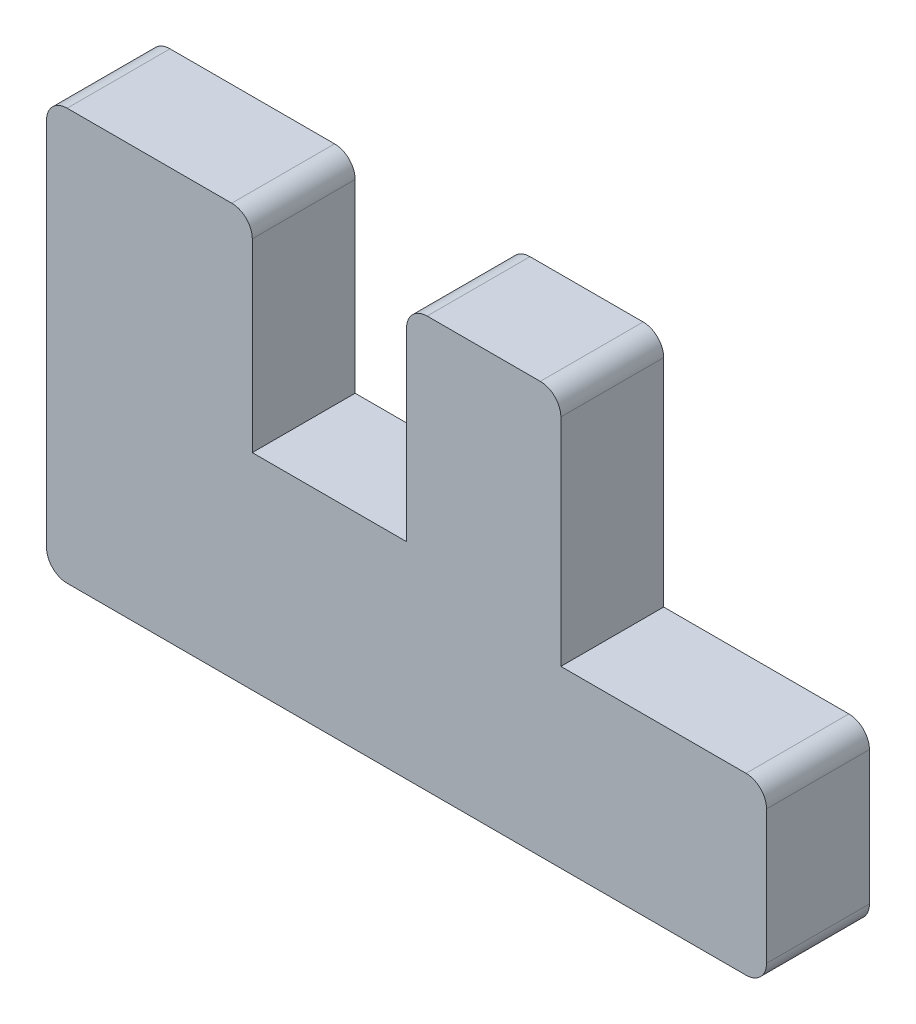
ISO-10303-21;
HEADER;
FILE_DESCRIPTION(('STEP AP214'),'2;1');
FILE_NAME('part.step','',(''),(''),'','','');
FILE_SCHEMA(('AUTOMOTIVE_DESIGN { 1 0 10303 214 1 1 1 1 }'));
ENDSEC;
DATA;
#1=APPLICATION_CONTEXT('core data for automotive mechanical design processes');
#2=APPLICATION_PROTOCOL_DEFINITION('international standard','automotive_design',2000,#1);
#3=PRODUCT_CONTEXT('',#1,'mechanical');
#4=PRODUCT('Part','Part','',(#3));
#5=PRODUCT_RELATED_PRODUCT_CATEGORY('part','',(#4));
#6=PRODUCT_DEFINITION_FORMATION('','',#4);
#7=PRODUCT_DEFINITION_CONTEXT('part definition',#1,'design');
#8=PRODUCT_DEFINITION('design','',#6,#7);
#9=PRODUCT_DEFINITION_SHAPE('','',#8);
#10=(LENGTH_UNIT() NAMED_UNIT(*) SI_UNIT(.MILLI.,.METRE.));
#11=(NAMED_UNIT(*) PLANE_ANGLE_UNIT() SI_UNIT($,.RADIAN.));
#12=(NAMED_UNIT(*) SI_UNIT($,.STERADIAN.) SOLID_ANGLE_UNIT());
#13=UNCERTAINTY_MEASURE_WITH_UNIT(LENGTH_MEASURE(1.E-05),#10,'distance_accuracy_value','');
#14=(GEOMETRIC_REPRESENTATION_CONTEXT(3) GLOBAL_UNCERTAINTY_ASSIGNED_CONTEXT((#13)) GLOBAL_UNIT_ASSIGNED_CONTEXT((#10,
#11,#12)) REPRESENTATION_CONTEXT('',''));
#15=CARTESIAN_POINT('',(0.,0.,0.));
#16=DIRECTION('',(0.,0.,1.));
#17=DIRECTION('',(1.,0.,0.));
#18=AXIS2_PLACEMENT_3D('',#15,#16,#17);
#19=CARTESIAN_POINT('',(0.,0.,12.7));
#20=DIRECTION('',(0.,1.,0.));
#21=DIRECTION('',(0.,0.,1.));
#22=AXIS2_PLACEMENT_3D('',#19,#20,#21);
#23=PLANE('',#22);
#24=DIRECTION('',(1.,0.,0.));
#25=VECTOR('',#24,1.);
#26=CARTESIAN_POINT('',(0.,0.,0.));
#27=LINE('',#26,#25);
#28=CARTESIAN_POINT('',(2.54,0.,0.));
#29=VERTEX_POINT('',#28);
#30=CARTESIAN_POINT('',(86.36,0.,0.));
#31=VERTEX_POINT('',#30);
#32=EDGE_CURVE('E219',#29,#31,#27,.T.);
#33=ORIENTED_EDGE('',*,*,#32,.T.);
#34=DIRECTION('',(0.,0.,-1.));
#35=VECTOR('',#34,1.);
#36=CARTESIAN_POINT('',(86.36,0.,12.7));
#37=LINE('',#36,#35);
#38=CARTESIAN_POINT('',(86.36,0.,12.7));
#39=VERTEX_POINT('',#38);
#40=EDGE_CURVE('E291',#31,#39,#37,.F.);
#41=ORIENTED_EDGE('',*,*,#40,.T.);
#42=DIRECTION('',(1.,0.,0.));
#43=VECTOR('',#42,1.);
#44=CARTESIAN_POINT('',(0.,0.,12.7));
#45=LINE('',#44,#43);
#46=CARTESIAN_POINT('',(2.54,0.,12.7));
#47=VERTEX_POINT('',#46);
#48=EDGE_CURVE('E253',#47,#39,#45,.T.);
#49=ORIENTED_EDGE('',*,*,#48,.F.);
#50=DIRECTION('',(0.,0.,-1.));
#51=VECTOR('',#50,1.);
#52=CARTESIAN_POINT('',(2.54,0.,12.7));
#53=LINE('',#52,#51);
#54=EDGE_CURVE('E287',#47,#29,#53,.T.);
#55=ORIENTED_EDGE('',*,*,#54,.T.);
#56=EDGE_LOOP('',(#33,#41,#49,#55));
#57=FACE_BOUND('',#56,.T.);
#58=ADVANCED_FACE('F43',(#57),#23,.F.);
#59=CARTESIAN_POINT('',(88.9,0.,12.7));
#60=DIRECTION('',(-1.,0.,0.));
#61=DIRECTION('',(0.,0.,1.));
#62=AXIS2_PLACEMENT_3D('',#59,#60,#61);
#63=PLANE('',#62);
#64=DIRECTION('',(0.,1.,0.));
#65=VECTOR('',#64,1.);
#66=CARTESIAN_POINT('',(88.9,0.,12.7));
#67=LINE('',#66,#65);
#68=CARTESIAN_POINT('',(88.9,2.54,12.7));
#69=VERTEX_POINT('',#68);
#70=CARTESIAN_POINT('',(88.9,19.05,12.7));
#71=VERTEX_POINT('',#70);
#72=EDGE_CURVE('E178',#69,#71,#67,.T.);
#73=ORIENTED_EDGE('',*,*,#72,.F.);
#74=DIRECTION('',(0.,0.,-1.));
#75=VECTOR('',#74,1.);
#76=CARTESIAN_POINT('',(88.9,2.54,12.7));
#77=LINE('',#76,#75);
#78=CARTESIAN_POINT('',(88.9,2.54,0.));
#79=VERTEX_POINT('',#78);
#80=EDGE_CURVE('E262',#69,#79,#77,.T.);
#81=ORIENTED_EDGE('',*,*,#80,.T.);
#82=DIRECTION('',(0.,1.,0.));
#83=VECTOR('',#82,1.);
#84=CARTESIAN_POINT('',(88.9,0.,0.));
#85=LINE('',#84,#83);
#86=CARTESIAN_POINT('',(88.9,19.05,0.));
#87=VERTEX_POINT('',#86);
#88=EDGE_CURVE('E223',#79,#87,#85,.T.);
#89=ORIENTED_EDGE('',*,*,#88,.T.);
#90=DIRECTION('',(0.,0.,-1.));
#91=VECTOR('',#90,1.);
#92=CARTESIAN_POINT('',(88.9,19.05,12.7));
#93=LINE('',#92,#91);
#94=EDGE_CURVE('E189',#87,#71,#93,.F.);
#95=ORIENTED_EDGE('',*,*,#94,.T.);
#96=EDGE_LOOP('',(#73,#81,#89,#95));
#97=FACE_BOUND('',#96,.T.);
#98=ADVANCED_FACE('F373',(#97),#63,.F.);
#99=CARTESIAN_POINT('',(88.9,21.59,12.7));
#100=DIRECTION('',(0.,-1.,0.));
#101=DIRECTION('',(0.,0.,-1.));
#102=AXIS2_PLACEMENT_3D('',#99,#100,#101);
#103=PLANE('',#102);
#104=DIRECTION('',(-1.,0.,0.));
#105=VECTOR('',#104,1.);
#106=CARTESIAN_POINT('',(88.9,21.59,12.7));
#107=LINE('',#106,#105);
#108=CARTESIAN_POINT('',(86.36,21.59,12.7));
#109=VERTEX_POINT('',#108);
#110=CARTESIAN_POINT('',(63.5,21.59,12.7));
#111=VERTEX_POINT('',#110);
#112=EDGE_CURVE('E164',#109,#111,#107,.T.);
#113=ORIENTED_EDGE('',*,*,#112,.F.);
#114=DIRECTION('',(0.,0.,-1.));
#115=VECTOR('',#114,1.);
#116=CARTESIAN_POINT('',(86.36,21.59,12.7));
#117=LINE('',#116,#115);
#118=CARTESIAN_POINT('',(86.36,21.59,0.));
#119=VERTEX_POINT('',#118);
#120=EDGE_CURVE('E313',#109,#119,#117,.T.);
#121=ORIENTED_EDGE('',*,*,#120,.T.);
#122=DIRECTION('',(-1.,0.,0.));
#123=VECTOR('',#122,1.);
#124=CARTESIAN_POINT('',(88.9,21.59,0.));
#125=LINE('',#124,#123);
#126=CARTESIAN_POINT('',(63.5,21.59,0.));
#127=VERTEX_POINT('',#126);
#128=EDGE_CURVE('E184',#119,#127,#125,.T.);
#129=ORIENTED_EDGE('',*,*,#128,.T.);
#130=DIRECTION('',(0.,0.,-1.));
#131=VECTOR('',#130,1.);
#132=CARTESIAN_POINT('',(63.5,21.59,12.7));
#133=LINE('',#132,#131);
#134=EDGE_CURVE('E181',#111,#127,#133,.T.);
#135=ORIENTED_EDGE('',*,*,#134,.F.);
#136=EDGE_LOOP('',(#113,#121,#129,#135));
#137=FACE_BOUND('',#136,.T.);
#138=ADVANCED_FACE('F182',(#137),#103,.F.);
#139=CARTESIAN_POINT('',(63.5,50.8,12.7));
#140=DIRECTION('',(-1.,0.,0.));
#141=DIRECTION('',(0.,0.,1.));
#142=AXIS2_PLACEMENT_3D('',#139,#140,#141);
#143=PLANE('',#142);
#144=DIRECTION('',(0.,1.,0.));
#145=VECTOR('',#144,1.);
#146=CARTESIAN_POINT('',(63.5,50.8,0.));
#147=LINE('',#146,#145);
#148=CARTESIAN_POINT('',(63.5,48.26,0.));
#149=VERTEX_POINT('',#148);
#150=EDGE_CURVE('E229',#127,#149,#147,.T.);
#151=ORIENTED_EDGE('',*,*,#150,.T.);
#152=DIRECTION('',(0.,0.,-1.));
#153=VECTOR('',#152,1.);
#154=CARTESIAN_POINT('',(63.5,48.26,12.7));
#155=LINE('',#154,#153);
#156=CARTESIAN_POINT('',(63.5,48.26,12.7));
#157=VERTEX_POINT('',#156);
#158=EDGE_CURVE('E52',#149,#157,#155,.F.);
#159=ORIENTED_EDGE('',*,*,#158,.T.);
#160=DIRECTION('',(0.,1.,0.));
#161=VECTOR('',#160,1.);
#162=CARTESIAN_POINT('',(63.5,50.8,12.7));
#163=LINE('',#162,#161);
#164=EDGE_CURVE('E169',#111,#157,#163,.T.);
#165=ORIENTED_EDGE('',*,*,#164,.F.);
#166=ORIENTED_EDGE('',*,*,#134,.T.);
#167=EDGE_LOOP('',(#151,#159,#165,#166));
#168=FACE_BOUND('',#167,.T.);
#169=ADVANCED_FACE('F192',(#168),#143,.F.);
#170=CARTESIAN_POINT('',(44.45,50.8,12.7));
#171=DIRECTION('',(0.,-1.,0.));
#172=DIRECTION('',(0.,0.,-1.));
#173=AXIS2_PLACEMENT_3D('',#170,#171,#172);
#174=PLANE('',#173);
#175=DIRECTION('',(-1.,0.,0.));
#176=VECTOR('',#175,1.);
#177=CARTESIAN_POINT('',(44.45,50.8,12.7));
#178=LINE('',#177,#176);
#179=CARTESIAN_POINT('',(60.96,50.8,12.7));
#180=VERTEX_POINT('',#179);
#181=CARTESIAN_POINT('',(46.99,50.8,12.7));
#182=VERTEX_POINT('',#181);
#183=EDGE_CURVE('E195',#180,#182,#178,.T.);
#184=ORIENTED_EDGE('',*,*,#183,.F.);
#185=DIRECTION('',(0.,0.,-1.));
#186=VECTOR('',#185,1.);
#187=CARTESIAN_POINT('',(60.96,50.8,12.7));
#188=LINE('',#187,#186);
#189=CARTESIAN_POINT('',(60.96,50.8,0.));
#190=VERTEX_POINT('',#189);
#191=EDGE_CURVE('E335',#180,#190,#188,.T.);
#192=ORIENTED_EDGE('',*,*,#191,.T.);
#193=DIRECTION('',(-1.,0.,0.));
#194=VECTOR('',#193,1.);
#195=CARTESIAN_POINT('',(44.45,50.8,0.));
#196=LINE('',#195,#194);
#197=CARTESIAN_POINT('',(46.99,50.8,0.));
#198=VERTEX_POINT('',#197);
#199=EDGE_CURVE('E232',#190,#198,#196,.T.);
#200=ORIENTED_EDGE('',*,*,#199,.T.);
#201=DIRECTION('',(0.,0.,-1.));
#202=VECTOR('',#201,1.);
#203=CARTESIAN_POINT('',(46.99,50.8,12.7));
#204=LINE('',#203,#202);
#205=EDGE_CURVE('E332',#198,#182,#204,.F.);
#206=ORIENTED_EDGE('',*,*,#205,.T.);
#207=EDGE_LOOP('',(#184,#192,#200,#206));
#208=FACE_BOUND('',#207,.T.);
#209=ADVANCED_FACE('F343',(#208),#174,.F.);
#210=CARTESIAN_POINT('',(44.45,25.4,12.7));
#211=DIRECTION('',(1.,0.,0.));
#212=DIRECTION('',(0.,0.,-1.));
#213=AXIS2_PLACEMENT_3D('',#210,#211,#212);
#214=PLANE('',#213);
#215=DIRECTION('',(0.,-1.,0.));
#216=VECTOR('',#215,1.);
#217=CARTESIAN_POINT('',(44.45,25.4,12.7));
#218=LINE('',#217,#216);
#219=CARTESIAN_POINT('',(44.45,48.26,12.7));
#220=VERTEX_POINT('',#219);
#221=CARTESIAN_POINT('',(44.45,25.4,12.7));
#222=VERTEX_POINT('',#221);
#223=EDGE_CURVE('E199',#220,#222,#218,.T.);
#224=ORIENTED_EDGE('',*,*,#223,.F.);
#225=DIRECTION('',(0.,0.,-1.));
#226=VECTOR('',#225,1.);
#227=CARTESIAN_POINT('',(44.45,48.26,12.7));
#228=LINE('',#227,#226);
#229=CARTESIAN_POINT('',(44.45,48.26,0.));
#230=VERTEX_POINT('',#229);
#231=EDGE_CURVE('E11',#220,#230,#228,.T.);
#232=ORIENTED_EDGE('',*,*,#231,.T.);
#233=DIRECTION('',(0.,-1.,0.));
#234=VECTOR('',#233,1.);
#235=CARTESIAN_POINT('',(44.45,25.4,0.));
#236=LINE('',#235,#234);
#237=CARTESIAN_POINT('',(44.45,25.4,0.));
#238=VERTEX_POINT('',#237);
#239=EDGE_CURVE('E236',#230,#238,#236,.T.);
#240=ORIENTED_EDGE('',*,*,#239,.T.);
#241=DIRECTION('',(0.,0.,-1.));
#242=VECTOR('',#241,1.);
#243=CARTESIAN_POINT('',(44.45,25.4,12.7));
#244=LINE('',#243,#242);
#245=EDGE_CURVE('E190',#222,#238,#244,.T.);
#246=ORIENTED_EDGE('',*,*,#245,.F.);
#247=EDGE_LOOP('',(#224,#232,#240,#246));
#248=FACE_BOUND('',#247,.T.);
#249=ADVANCED_FACE('F357',(#248),#214,.F.);
#250=CARTESIAN_POINT('',(25.4,25.4,12.7));
#251=DIRECTION('',(0.,-1.,0.));
#252=DIRECTION('',(1.,0.,0.));
#253=AXIS2_PLACEMENT_3D('',#250,#251,#252);
#254=PLANE('',#253);
#255=DIRECTION('',(-1.,0.,0.));
#256=VECTOR('',#255,1.);
#257=CARTESIAN_POINT('',(25.4,25.4,0.));
#258=LINE('',#257,#256);
#259=CARTESIAN_POINT('',(25.4,25.4,0.));
#260=VERTEX_POINT('',#259);
#261=EDGE_CURVE('E239',#238,#260,#258,.T.);
#262=ORIENTED_EDGE('',*,*,#261,.T.);
#263=DIRECTION('',(0.,0.,-1.));
#264=VECTOR('',#263,1.);
#265=CARTESIAN_POINT('',(25.4,25.4,12.7));
#266=LINE('',#265,#264);
#267=CARTESIAN_POINT('',(25.4,25.4,12.7));
#268=VERTEX_POINT('',#267);
#269=EDGE_CURVE('E218',#268,#260,#266,.T.);
#270=ORIENTED_EDGE('',*,*,#269,.F.);
#271=DIRECTION('',(-1.,0.,0.));
#272=VECTOR('',#271,1.);
#273=CARTESIAN_POINT('',(25.4,25.4,12.7));
#274=LINE('',#273,#272);
#275=EDGE_CURVE('E205',#222,#268,#274,.T.);
#276=ORIENTED_EDGE('',*,*,#275,.F.);
#277=ORIENTED_EDGE('',*,*,#245,.T.);
#278=EDGE_LOOP('',(#262,#270,#276,#277));
#279=FACE_BOUND('',#278,.T.);
#280=ADVANCED_FACE('F424',(#279),#254,.F.);
#281=CARTESIAN_POINT('',(25.4,50.8,12.7));
#282=DIRECTION('',(-1.,0.,0.));
#283=DIRECTION('',(0.,-1.,0.));
#284=AXIS2_PLACEMENT_3D('',#281,#282,#283);
#285=PLANE('',#284);
#286=DIRECTION('',(0.,1.,0.));
#287=VECTOR('',#286,1.);
#288=CARTESIAN_POINT('',(25.4,50.8,0.));
#289=LINE('',#288,#287);
#290=CARTESIAN_POINT('',(25.4,48.26,0.));
#291=VERTEX_POINT('',#290);
#292=EDGE_CURVE('E242',#260,#291,#289,.T.);
#293=ORIENTED_EDGE('',*,*,#292,.T.);
#294=DIRECTION('',(0.,0.,-1.));
#295=VECTOR('',#294,1.);
#296=CARTESIAN_POINT('',(25.4,48.26,12.7));
#297=LINE('',#296,#295);
#298=CARTESIAN_POINT('',(25.4,48.26,12.7));
#299=VERTEX_POINT('',#298);
#300=EDGE_CURVE('E329',#291,#299,#297,.F.);
#301=ORIENTED_EDGE('',*,*,#300,.T.);
#302=DIRECTION('',(0.,1.,0.));
#303=VECTOR('',#302,1.);
#304=CARTESIAN_POINT('',(25.4,50.8,12.7));
#305=LINE('',#304,#303);
#306=EDGE_CURVE('E208',#268,#299,#305,.T.);
#307=ORIENTED_EDGE('',*,*,#306,.F.);
#308=ORIENTED_EDGE('',*,*,#269,.T.);
#309=EDGE_LOOP('',(#293,#301,#307,#308));
#310=FACE_BOUND('',#309,.T.);
#311=ADVANCED_FACE('F421',(#310),#285,.F.);
#312=CARTESIAN_POINT('',(0.,50.8,12.7));
#313=DIRECTION('',(0.,-1.,0.));
#314=DIRECTION('',(0.,0.,-1.));
#315=AXIS2_PLACEMENT_3D('',#312,#313,#314);
#316=PLANE('',#315);
#317=DIRECTION('',(-1.,0.,0.));
#318=VECTOR('',#317,1.);
#319=CARTESIAN_POINT('',(0.,50.8,12.7));
#320=LINE('',#319,#318);
#321=CARTESIAN_POINT('',(22.86,50.8,12.7));
#322=VERTEX_POINT('',#321);
#323=CARTESIAN_POINT('',(2.54,50.8,12.7));
#324=VERTEX_POINT('',#323);
#325=EDGE_CURVE('E212',#322,#324,#320,.T.);
#326=ORIENTED_EDGE('',*,*,#325,.F.);
#327=DIRECTION('',(0.,0.,-1.));
#328=VECTOR('',#327,1.);
#329=CARTESIAN_POINT('',(22.86,50.8,12.7));
#330=LINE('',#329,#328);
#331=CARTESIAN_POINT('',(22.86,50.8,0.));
#332=VERTEX_POINT('',#331);
#333=EDGE_CURVE('E325',#322,#332,#330,.T.);
#334=ORIENTED_EDGE('',*,*,#333,.T.);
#335=DIRECTION('',(-1.,0.,0.));
#336=VECTOR('',#335,1.);
#337=CARTESIAN_POINT('',(0.,50.8,0.));
#338=LINE('',#337,#336);
#339=CARTESIAN_POINT('',(2.54,50.8,0.));
#340=VERTEX_POINT('',#339);
#341=EDGE_CURVE('E246',#332,#340,#338,.T.);
#342=ORIENTED_EDGE('',*,*,#341,.T.);
#343=DIRECTION('',(0.,0.,-1.));
#344=VECTOR('',#343,1.);
#345=CARTESIAN_POINT('',(2.54,50.8,12.7));
#346=LINE('',#345,#344);
#347=EDGE_CURVE('E322',#340,#324,#346,.F.);
#348=ORIENTED_EDGE('',*,*,#347,.T.);
#349=EDGE_LOOP('',(#326,#334,#342,#348));
#350=FACE_BOUND('',#349,.T.);
#351=ADVANCED_FACE('F415',(#350),#316,.F.);
#352=CARTESIAN_POINT('',(0.,0.,12.7));
#353=DIRECTION('',(1.,0.,0.));
#354=DIRECTION('',(0.,0.,-1.));
#355=AXIS2_PLACEMENT_3D('',#352,#353,#354);
#356=PLANE('',#355);
#357=DIRECTION('',(0.,-1.,0.));
#358=VECTOR('',#357,1.);
#359=CARTESIAN_POINT('',(0.,0.,0.));
#360=LINE('',#359,#358);
#361=CARTESIAN_POINT('',(0.,48.26,0.));
#362=VERTEX_POINT('',#361);
#363=CARTESIAN_POINT('',(0.,2.54,0.));
#364=VERTEX_POINT('',#363);
#365=EDGE_CURVE('E250',#362,#364,#360,.T.);
#366=ORIENTED_EDGE('',*,*,#365,.T.);
#367=DIRECTION('',(0.,0.,-1.));
#368=VECTOR('',#367,1.);
#369=CARTESIAN_POINT('',(0.,2.54,12.7));
#370=LINE('',#369,#368);
#371=CARTESIAN_POINT('',(0.,2.54,12.7));
#372=VERTEX_POINT('',#371);
#373=EDGE_CURVE('E59',#364,#372,#370,.F.);
#374=ORIENTED_EDGE('',*,*,#373,.T.);
#375=DIRECTION('',(0.,-1.,0.));
#376=VECTOR('',#375,1.);
#377=CARTESIAN_POINT('',(0.,0.,12.7));
#378=LINE('',#377,#376);
#379=CARTESIAN_POINT('',(0.,48.26,12.7));
#380=VERTEX_POINT('',#379);
#381=EDGE_CURVE('E215',#380,#372,#378,.T.);
#382=ORIENTED_EDGE('',*,*,#381,.F.);
#383=DIRECTION('',(0.,0.,-1.));
#384=VECTOR('',#383,1.);
#385=CARTESIAN_POINT('',(0.,48.26,12.7));
#386=LINE('',#385,#384);
#387=EDGE_CURVE('E316',#380,#362,#386,.T.);
#388=ORIENTED_EDGE('',*,*,#387,.T.);
#389=EDGE_LOOP('',(#366,#374,#382,#388));
#390=FACE_BOUND('',#389,.T.);
#391=ADVANCED_FACE('F408',(#390),#356,.F.);
#392=CARTESIAN_POINT('',(0.,0.,12.7));
#393=DIRECTION('',(0.,0.,1.));
#394=DIRECTION('',(1.,0.,0.));
#395=AXIS2_PLACEMENT_3D('',#392,#393,#394);
#396=PLANE('',#395);
#397=ORIENTED_EDGE('',*,*,#48,.T.);
#398=CARTESIAN_POINT('',(86.36,2.54,12.7));
#399=DIRECTION('',(0.,0.,1.));
#400=DIRECTION('',(1.,0.,0.));
#401=AXIS2_PLACEMENT_3D('',#398,#399,#400);
#402=CIRCLE('',#401,2.54);
#403=EDGE_CURVE('E310',#39,#69,#402,.T.);
#404=ORIENTED_EDGE('',*,*,#403,.T.);
#405=ORIENTED_EDGE('',*,*,#72,.T.);
#406=CARTESIAN_POINT('',(86.36,19.05,12.7));
#407=DIRECTION('',(0.,0.,1.));
#408=DIRECTION('',(1.,0.,0.));
#409=AXIS2_PLACEMENT_3D('',#406,#407,#408);
#410=CIRCLE('',#409,2.54);
#411=EDGE_CURVE('E173',#71,#109,#410,.T.);
#412=ORIENTED_EDGE('',*,*,#411,.T.);
#413=ORIENTED_EDGE('',*,*,#112,.T.);
#414=ORIENTED_EDGE('',*,*,#164,.T.);
#415=CARTESIAN_POINT('',(60.96,48.26,12.7));
#416=DIRECTION('',(0.,0.,1.));
#417=DIRECTION('',(1.,0.,0.));
#418=AXIS2_PLACEMENT_3D('',#415,#416,#417);
#419=CIRCLE('',#418,2.54);
#420=EDGE_CURVE('E299',#157,#180,#419,.T.);
#421=ORIENTED_EDGE('',*,*,#420,.T.);
#422=ORIENTED_EDGE('',*,*,#183,.T.);
#423=CARTESIAN_POINT('',(46.99,48.26,12.7));
#424=DIRECTION('',(0.,0.,1.));
#425=DIRECTION('',(1.,0.,0.));
#426=AXIS2_PLACEMENT_3D('',#423,#424,#425);
#427=CIRCLE('',#426,2.54);
#428=EDGE_CURVE('E296',#182,#220,#427,.T.);
#429=ORIENTED_EDGE('',*,*,#428,.T.);
#430=ORIENTED_EDGE('',*,*,#223,.T.);
#431=ORIENTED_EDGE('',*,*,#275,.T.);
#432=ORIENTED_EDGE('',*,*,#306,.T.);
#433=CARTESIAN_POINT('',(22.86,48.26,12.7));
#434=DIRECTION('',(0.,0.,1.));
#435=DIRECTION('',(1.,0.,0.));
#436=AXIS2_PLACEMENT_3D('',#433,#434,#435);
#437=CIRCLE('',#436,2.54);
#438=EDGE_CURVE('E302',#299,#322,#437,.T.);
#439=ORIENTED_EDGE('',*,*,#438,.T.);
#440=ORIENTED_EDGE('',*,*,#325,.T.);
#441=CARTESIAN_POINT('',(2.54,48.26,12.7));
#442=DIRECTION('',(0.,0.,1.));
#443=DIRECTION('',(1.,0.,0.));
#444=AXIS2_PLACEMENT_3D('',#441,#442,#443);
#445=CIRCLE('',#444,2.54);
#446=EDGE_CURVE('E66',#324,#380,#445,.T.);
#447=ORIENTED_EDGE('',*,*,#446,.T.);
#448=ORIENTED_EDGE('',*,*,#381,.T.);
#449=CARTESIAN_POINT('',(2.54,2.54,12.7));
#450=DIRECTION('',(0.,0.,1.));
#451=DIRECTION('',(1.,0.,0.));
#452=AXIS2_PLACEMENT_3D('',#449,#450,#451);
#453=CIRCLE('',#452,2.54);
#454=EDGE_CURVE('E305',#372,#47,#453,.T.);
#455=ORIENTED_EDGE('',*,*,#454,.T.);
#456=EDGE_LOOP('',(#397,#404,#405,#412,#413,#414,#421,#422,#429,#430,#431,#432,#439,#440,#447,
#448,#455));
#457=FACE_BOUND('',#456,.T.);
#458=ADVANCED_FACE('F167',(#457),#396,.T.);
#459=CARTESIAN_POINT('',(0.,0.,0.));
#460=DIRECTION('',(0.,0.,1.));
#461=DIRECTION('',(1.,0.,0.));
#462=AXIS2_PLACEMENT_3D('',#459,#460,#461);
#463=PLANE('',#462);
#464=ORIENTED_EDGE('',*,*,#88,.F.);
#465=CARTESIAN_POINT('',(86.36,2.54,0.));
#466=DIRECTION('',(0.,0.,1.));
#467=DIRECTION('',(1.,0.,0.));
#468=AXIS2_PLACEMENT_3D('',#465,#466,#467);
#469=CIRCLE('',#468,2.54);
#470=EDGE_CURVE('E284',#79,#31,#469,.F.);
#471=ORIENTED_EDGE('',*,*,#470,.T.);
#472=ORIENTED_EDGE('',*,*,#32,.F.);
#473=CARTESIAN_POINT('',(2.54,2.54,0.));
#474=DIRECTION('',(0.,0.,1.));
#475=DIRECTION('',(1.,0.,0.));
#476=AXIS2_PLACEMENT_3D('',#473,#474,#475);
#477=CIRCLE('',#476,2.54);
#478=EDGE_CURVE('E278',#29,#364,#477,.F.);
#479=ORIENTED_EDGE('',*,*,#478,.T.);
#480=ORIENTED_EDGE('',*,*,#365,.F.);
#481=CARTESIAN_POINT('',(2.54,48.26,0.));
#482=DIRECTION('',(0.,0.,1.));
#483=DIRECTION('',(1.,0.,0.));
#484=AXIS2_PLACEMENT_3D('',#481,#482,#483);
#485=CIRCLE('',#484,2.54);
#486=EDGE_CURVE('E266',#362,#340,#485,.F.);
#487=ORIENTED_EDGE('',*,*,#486,.T.);
#488=ORIENTED_EDGE('',*,*,#341,.F.);
#489=CARTESIAN_POINT('',(22.86,48.26,0.));
#490=DIRECTION('',(0.,0.,1.));
#491=DIRECTION('',(1.,0.,0.));
#492=AXIS2_PLACEMENT_3D('',#489,#490,#491);
#493=CIRCLE('',#492,2.54);
#494=EDGE_CURVE('E275',#332,#291,#493,.F.);
#495=ORIENTED_EDGE('',*,*,#494,.T.);
#496=ORIENTED_EDGE('',*,*,#292,.F.);
#497=ORIENTED_EDGE('',*,*,#261,.F.);
#498=ORIENTED_EDGE('',*,*,#239,.F.);
#499=CARTESIAN_POINT('',(46.99,48.26,0.));
#500=DIRECTION('',(0.,0.,1.));
#501=DIRECTION('',(1.,0.,0.));
#502=AXIS2_PLACEMENT_3D('',#499,#500,#501);
#503=CIRCLE('',#502,2.54);
#504=EDGE_CURVE('E269',#230,#198,#503,.F.);
#505=ORIENTED_EDGE('',*,*,#504,.T.);
#506=ORIENTED_EDGE('',*,*,#199,.F.);
#507=CARTESIAN_POINT('',(60.96,48.26,0.));
#508=DIRECTION('',(0.,0.,1.));
#509=DIRECTION('',(1.,0.,0.));
#510=AXIS2_PLACEMENT_3D('',#507,#508,#509);
#511=CIRCLE('',#510,2.54);
#512=EDGE_CURVE('E272',#190,#149,#511,.F.);
#513=ORIENTED_EDGE('',*,*,#512,.T.);
#514=ORIENTED_EDGE('',*,*,#150,.F.);
#515=ORIENTED_EDGE('',*,*,#128,.F.);
#516=CARTESIAN_POINT('',(86.36,19.05,0.));
#517=DIRECTION('',(0.,0.,1.));
#518=DIRECTION('',(1.,0.,0.));
#519=AXIS2_PLACEMENT_3D('',#516,#517,#518);
#520=CIRCLE('',#519,2.54);
#521=EDGE_CURVE('E281',#119,#87,#520,.F.);
#522=ORIENTED_EDGE('',*,*,#521,.T.);
#523=EDGE_LOOP('',(#464,#471,#472,#479,#480,#487,#488,#495,#496,#497,#498,#505,#506,#513,#514,
#515,#522));
#524=FACE_BOUND('',#523,.T.);
#525=ADVANCED_FACE('F348',(#524),#463,.F.);
#526=CARTESIAN_POINT('',(86.36,2.54,12.7));
#527=DIRECTION('',(0.,0.,-1.));
#528=DIRECTION('',(-1.,0.,0.));
#529=AXIS2_PLACEMENT_3D('',#526,#527,#528);
#530=CYLINDRICAL_SURFACE('',#529,2.54);
#531=ORIENTED_EDGE('',*,*,#403,.F.);
#532=ORIENTED_EDGE('',*,*,#40,.F.);
#533=ORIENTED_EDGE('',*,*,#470,.F.);
#534=ORIENTED_EDGE('',*,*,#80,.F.);
#535=EDGE_LOOP('',(#531,#532,#533,#534));
#536=FACE_BOUND('',#535,.T.);
#537=ADVANCED_FACE('F383',(#536),#530,.T.);
#538=CARTESIAN_POINT('',(86.36,19.05,12.7));
#539=DIRECTION('',(0.,0.,-1.));
#540=DIRECTION('',(-1.,0.,0.));
#541=AXIS2_PLACEMENT_3D('',#538,#539,#540);
#542=CYLINDRICAL_SURFACE('',#541,2.54);
#543=ORIENTED_EDGE('',*,*,#411,.F.);
#544=ORIENTED_EDGE('',*,*,#94,.F.);
#545=ORIENTED_EDGE('',*,*,#521,.F.);
#546=ORIENTED_EDGE('',*,*,#120,.F.);
#547=EDGE_LOOP('',(#543,#544,#545,#546));
#548=FACE_BOUND('',#547,.T.);
#549=ADVANCED_FACE('F386',(#548),#542,.T.);
#550=CARTESIAN_POINT('',(2.54,2.54,12.7));
#551=DIRECTION('',(0.,0.,-1.));
#552=DIRECTION('',(-1.,0.,0.));
#553=AXIS2_PLACEMENT_3D('',#550,#551,#552);
#554=CYLINDRICAL_SURFACE('',#553,2.54);
#555=ORIENTED_EDGE('',*,*,#454,.F.);
#556=ORIENTED_EDGE('',*,*,#373,.F.);
#557=ORIENTED_EDGE('',*,*,#478,.F.);
#558=ORIENTED_EDGE('',*,*,#54,.F.);
#559=EDGE_LOOP('',(#555,#556,#557,#558));
#560=FACE_BOUND('',#559,.T.);
#561=ADVANCED_FACE('F369',(#560),#554,.T.);
#562=CARTESIAN_POINT('',(22.86,48.26,12.7));
#563=DIRECTION('',(0.,0.,-1.));
#564=DIRECTION('',(-1.,0.,0.));
#565=AXIS2_PLACEMENT_3D('',#562,#563,#564);
#566=CYLINDRICAL_SURFACE('',#565,2.54);
#567=ORIENTED_EDGE('',*,*,#438,.F.);
#568=ORIENTED_EDGE('',*,*,#300,.F.);
#569=ORIENTED_EDGE('',*,*,#494,.F.);
#570=ORIENTED_EDGE('',*,*,#333,.F.);
#571=EDGE_LOOP('',(#567,#568,#569,#570));
#572=FACE_BOUND('',#571,.T.);
#573=ADVANCED_FACE('F363',(#572),#566,.T.);
#574=CARTESIAN_POINT('',(60.96,48.26,12.7));
#575=DIRECTION('',(0.,0.,-1.));
#576=DIRECTION('',(-1.,0.,0.));
#577=AXIS2_PLACEMENT_3D('',#574,#575,#576);
#578=CYLINDRICAL_SURFACE('',#577,2.54);
#579=ORIENTED_EDGE('',*,*,#420,.F.);
#580=ORIENTED_EDGE('',*,*,#158,.F.);
#581=ORIENTED_EDGE('',*,*,#512,.F.);
#582=ORIENTED_EDGE('',*,*,#191,.F.);
#583=EDGE_LOOP('',(#579,#580,#581,#582));
#584=FACE_BOUND('',#583,.T.);
#585=ADVANCED_FACE('F361',(#584),#578,.T.);
#586=CARTESIAN_POINT('',(46.99,48.26,12.7));
#587=DIRECTION('',(0.,0.,-1.));
#588=DIRECTION('',(-1.,0.,0.));
#589=AXIS2_PLACEMENT_3D('',#586,#587,#588);
#590=CYLINDRICAL_SURFACE('',#589,2.54);
#591=ORIENTED_EDGE('',*,*,#428,.F.);
#592=ORIENTED_EDGE('',*,*,#205,.F.);
#593=ORIENTED_EDGE('',*,*,#504,.F.);
#594=ORIENTED_EDGE('',*,*,#231,.F.);
#595=EDGE_LOOP('',(#591,#592,#593,#594));
#596=FACE_BOUND('',#595,.T.);
#597=ADVANCED_FACE('F354',(#596),#590,.T.);
#598=CARTESIAN_POINT('',(2.54,48.26,12.7));
#599=DIRECTION('',(0.,0.,-1.));
#600=DIRECTION('',(-1.,0.,0.));
#601=AXIS2_PLACEMENT_3D('',#598,#599,#600);
#602=CYLINDRICAL_SURFACE('',#601,2.54);
#603=ORIENTED_EDGE('',*,*,#446,.F.);
#604=ORIENTED_EDGE('',*,*,#347,.F.);
#605=ORIENTED_EDGE('',*,*,#486,.F.);
#606=ORIENTED_EDGE('',*,*,#387,.F.);
#607=EDGE_LOOP('',(#603,#604,#605,#606));
#608=FACE_BOUND('',#607,.T.);
#609=ADVANCED_FACE('F45',(#608),#602,.T.);
#610=CLOSED_SHELL('',(#58,#98,#138,#169,#209,#249,#280,#311,#351,#391,#458,#525,#537,#549,#561,
#573,#585,#597,#609));
#611=MANIFOLD_SOLID_BREP('B2',#610);
#612=ADVANCED_BREP_SHAPE_REPRESENTATION('',(#18,#611),#14);
#613=SHAPE_DEFINITION_REPRESENTATION(#9,#612);
ENDSEC;
END-ISO-10303-21;
